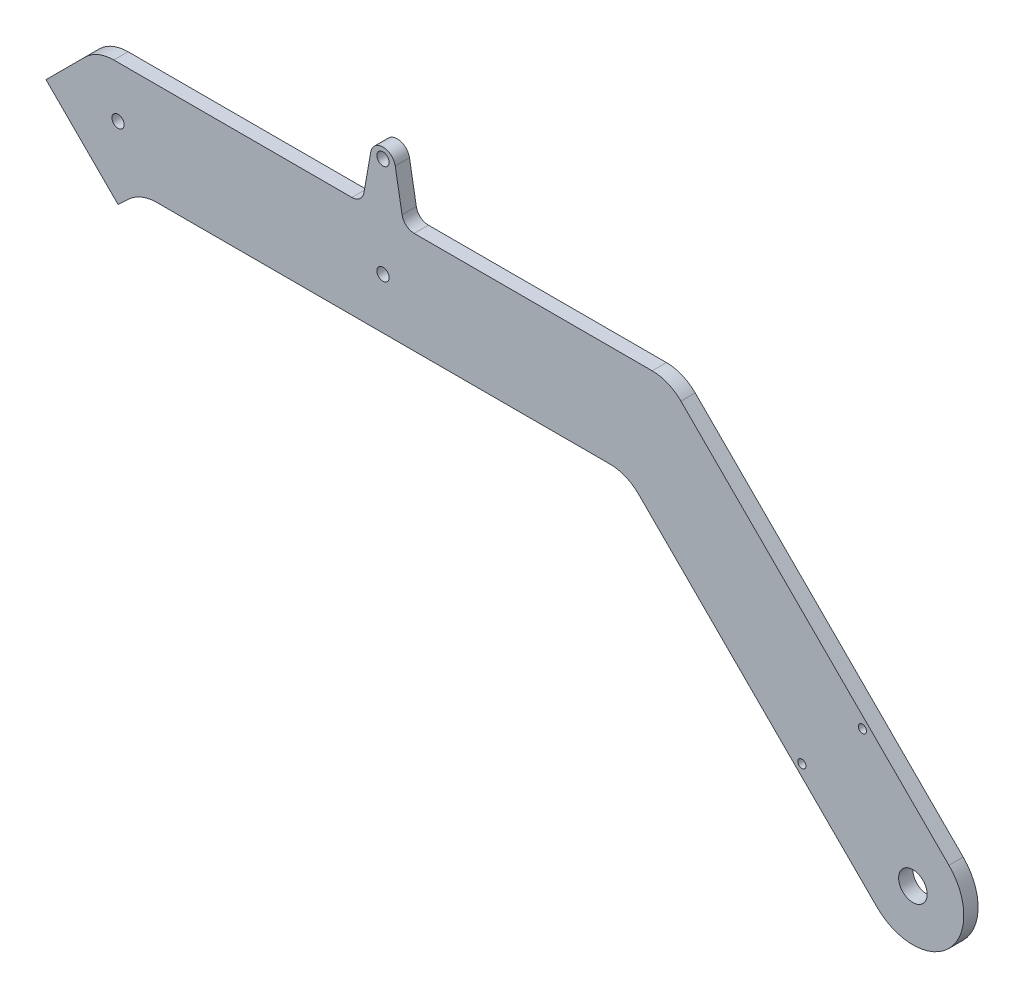
ISO-10303-21;
HEADER;
FILE_DESCRIPTION(('STEP AP214'),'2;1');
FILE_NAME('part.step','',(''),(''),'','','');
FILE_SCHEMA(('AUTOMOTIVE_DESIGN { 1 0 10303 214 1 1 1 1 }'));
ENDSEC;
DATA;
#1=APPLICATION_CONTEXT('core data for automotive mechanical design processes');
#2=APPLICATION_PROTOCOL_DEFINITION('international standard','automotive_design',2000,#1);
#3=PRODUCT_CONTEXT('',#1,'mechanical');
#4=PRODUCT('Part','Part','',(#3));
#5=PRODUCT_RELATED_PRODUCT_CATEGORY('part','',(#4));
#6=PRODUCT_DEFINITION_FORMATION('','',#4);
#7=PRODUCT_DEFINITION_CONTEXT('part definition',#1,'design');
#8=PRODUCT_DEFINITION('design','',#6,#7);
#9=PRODUCT_DEFINITION_SHAPE('','',#8);
#10=(LENGTH_UNIT() NAMED_UNIT(*) SI_UNIT(.MILLI.,.METRE.));
#11=(NAMED_UNIT(*) PLANE_ANGLE_UNIT() SI_UNIT($,.RADIAN.));
#12=(NAMED_UNIT(*) SI_UNIT($,.STERADIAN.) SOLID_ANGLE_UNIT());
#13=UNCERTAINTY_MEASURE_WITH_UNIT(LENGTH_MEASURE(1.E-05),#10,'distance_accuracy_value','');
#14=(GEOMETRIC_REPRESENTATION_CONTEXT(3) GLOBAL_UNCERTAINTY_ASSIGNED_CONTEXT((#13)) GLOBAL_UNIT_ASSIGNED_CONTEXT((#10,
#11,#12)) REPRESENTATION_CONTEXT('',''));
#15=CARTESIAN_POINT('',(0.,0.,0.));
#16=DIRECTION('',(0.,0.,1.));
#17=DIRECTION('',(1.,0.,0.));
#18=AXIS2_PLACEMENT_3D('',#15,#16,#17);
#19=CARTESIAN_POINT('',(195.,1.22188156226242E-13,3.5));
#20=DIRECTION('',(0.,0.,-1.));
#21=DIRECTION('',(-1.,0.,0.));
#22=AXIS2_PLACEMENT_3D('',#19,#20,#21);
#23=PLANE('',#22);
#24=CARTESIAN_POINT('',(167.776388924318,12.3743686707647,3.5));
#25=DIRECTION('',(0.,0.,-1.));
#26=DIRECTION('',(-1.,0.,0.));
#27=AXIS2_PLACEMENT_3D('',#24,#25,#26);
#28=CIRCLE('',#27,0.999999999999998);
#29=CARTESIAN_POINT('',(166.776388924318,12.3743686707647,3.5));
#30=VERTEX_POINT('',#29);
#31=EDGE_CURVE('E605',#30,#30,#28,.T.);
#32=ORIENTED_EDGE('',*,*,#31,.T.);
#33=EDGE_LOOP('',(#32));
#34=FACE_BOUND('',#33,.T.);
#35=CARTESIAN_POINT('',(182.625631329236,27.2236110756822,3.5));
#36=DIRECTION('',(0.,0.,-1.));
#37=DIRECTION('',(-1.,0.,0.));
#38=AXIS2_PLACEMENT_3D('',#35,#36,#37);
#39=CIRCLE('',#38,1.00000000000003);
#40=CARTESIAN_POINT('',(181.625631329236,27.2236110756822,3.5));
#41=VERTEX_POINT('',#40);
#42=EDGE_CURVE('E609',#41,#41,#39,.T.);
#43=ORIENTED_EDGE('',*,*,#42,.T.);
#44=EDGE_LOOP('',(#43));
#45=FACE_BOUND('',#44,.T.);
#46=DIRECTION('',(-0.707106781186548,0.707106781186547,0.));
#47=VECTOR('',#46,1.);
#48=CARTESIAN_POINT('',(135.177669529664,77.5000000000002,3.5));
#49=LINE('',#48,#47);
#50=CARTESIAN_POINT('',(203.838834764832,8.83883476483199,3.5));
#51=VERTEX_POINT('',#50);
#52=CARTESIAN_POINT('',(138.106601717798,74.5710678118657,3.5));
#53=VERTEX_POINT('',#52);
#54=EDGE_CURVE('E188',#51,#53,#49,.T.);
#55=ORIENTED_EDGE('',*,*,#54,.T.);
#56=CARTESIAN_POINT('',(131.035533905933,67.5000000000002,3.5));
#57=DIRECTION('',(0.,0.,-1.));
#58=DIRECTION('',(-1.,0.,0.));
#59=AXIS2_PLACEMENT_3D('',#56,#57,#58);
#60=CIRCLE('',#59,10.);
#61=CARTESIAN_POINT('',(131.035533905933,77.5000000000002,3.5));
#62=VERTEX_POINT('',#61);
#63=EDGE_CURVE('E263',#53,#62,#60,.F.);
#64=ORIENTED_EDGE('',*,*,#63,.T.);
#65=DIRECTION('',(-1.,0.,0.));
#66=VECTOR('',#65,1.);
#67=CARTESIAN_POINT('',(70.1159237685017,77.5000000000003,3.5));
#68=LINE('',#67,#66);
#69=CARTESIAN_POINT('',(72.6332226620335,77.5000000000003,3.5));
#70=VERTEX_POINT('',#69);
#71=EDGE_CURVE('E190',#62,#70,#68,.T.);
#72=ORIENTED_EDGE('',*,*,#71,.T.);
#73=CARTESIAN_POINT('',(72.6332226620335,80.5000000000003,3.5));
#74=DIRECTION('',(0.,0.,-1.));
#75=DIRECTION('',(-1.,0.,0.));
#76=AXIS2_PLACEMENT_3D('',#73,#74,#75);
#77=CIRCLE('',#76,3.);
#78=CARTESIAN_POINT('',(69.6787994029969,79.9790554669995,3.5));
#79=VERTEX_POINT('',#78);
#80=EDGE_CURVE('E11',#70,#79,#77,.T.);
#81=ORIENTED_EDGE('',*,*,#80,.T.);
#82=DIRECTION('',(-0.173648177666929,0.984807753012208,0.));
#83=VECTOR('',#82,1.);
#84=CARTESIAN_POINT('',(70.1159237685017,77.5000000000003,3.5));
#85=LINE('',#84,#83);
#86=CARTESIAN_POINT('',(68.0000000000001,89.5000000000003,3.5));
#87=VERTEX_POINT('',#86);
#88=EDGE_CURVE('E195',#79,#87,#85,.T.);
#89=ORIENTED_EDGE('',*,*,#88,.T.);
#90=CARTESIAN_POINT('',(65.0000000000001,88.9710190578749,3.5));
#91=DIRECTION('',(0.,0.,1.));
#92=DIRECTION('',(1.,0.,0.));
#93=AXIS2_PLACEMENT_3D('',#90,#91,#92);
#94=CIRCLE('',#93,3.04627983565722);
#95=CARTESIAN_POINT('',(62.0000000000001,89.5000000000003,3.5));
#96=VERTEX_POINT('',#95);
#97=EDGE_CURVE('E197',#87,#96,#94,.T.);
#98=ORIENTED_EDGE('',*,*,#97,.T.);
#99=DIRECTION('',(-0.173648177666927,-0.984807753012209,0.));
#100=VECTOR('',#99,1.);
#101=CARTESIAN_POINT('',(59.8840762314986,77.5000000000003,3.5));
#102=LINE('',#101,#100);
#103=CARTESIAN_POINT('',(60.3212005970034,79.9790554669995,3.5));
#104=VERTEX_POINT('',#103);
#105=EDGE_CURVE('E199',#96,#104,#102,.T.);
#106=ORIENTED_EDGE('',*,*,#105,.T.);
#107=CARTESIAN_POINT('',(57.3667773379668,80.5000000000003,3.5));
#108=DIRECTION('',(0.,0.,-1.));
#109=DIRECTION('',(-1.,0.,0.));
#110=AXIS2_PLACEMENT_3D('',#107,#108,#109);
#111=CIRCLE('',#110,3.);
#112=CARTESIAN_POINT('',(57.3667773379668,77.5000000000003,3.5));
#113=VERTEX_POINT('',#112);
#114=EDGE_CURVE('E298',#104,#113,#111,.T.);
#115=ORIENTED_EDGE('',*,*,#114,.T.);
#116=DIRECTION('',(-1.,0.,0.));
#117=VECTOR('',#116,1.);
#118=CARTESIAN_POINT('',(-5.17766952966342,77.5000000000003,3.5));
#119=LINE('',#118,#117);
#120=CARTESIAN_POINT('',(-1.03553390593246,77.5000000000003,3.5));
#121=VERTEX_POINT('',#120);
#122=EDGE_CURVE('E202',#113,#121,#119,.T.);
#123=ORIENTED_EDGE('',*,*,#122,.T.);
#124=CARTESIAN_POINT('',(-1.03553390593246,67.5000000000003,3.5));
#125=DIRECTION('',(0.,0.,-1.));
#126=DIRECTION('',(-1.,0.,0.));
#127=AXIS2_PLACEMENT_3D('',#124,#125,#126);
#128=CIRCLE('',#127,10.);
#129=CARTESIAN_POINT('',(-8.10660171779794,74.5710678118657,3.5));
#130=VERTEX_POINT('',#129);
#131=EDGE_CURVE('E261',#121,#130,#128,.F.);
#132=ORIENTED_EDGE('',*,*,#131,.T.);
#133=DIRECTION('',(-0.707106781186547,-0.707106781186548,0.));
#134=VECTOR('',#133,1.);
#135=CARTESIAN_POINT('',(-17.6776695296635,65.0000000000002,3.5));
#136=LINE('',#135,#134);
#137=CARTESIAN_POINT('',(-17.6776695296635,65.0000000000002,3.5));
#138=VERTEX_POINT('',#137);
#139=EDGE_CURVE('E204',#130,#138,#136,.T.);
#140=ORIENTED_EDGE('',*,*,#139,.T.);
#141=DIRECTION('',(0.707106781186548,-0.707106781186547,0.));
#142=VECTOR('',#141,1.);
#143=CARTESIAN_POINT('',(2.22044604925031E-13,47.3223304703365,3.5));
#144=LINE('',#143,#142);
#145=CARTESIAN_POINT('',(2.22044604925031E-13,47.3223304703365,3.5));
#146=VERTEX_POINT('',#145);
#147=EDGE_CURVE('E206',#138,#146,#144,.T.);
#148=ORIENTED_EDGE('',*,*,#147,.T.);
#149=DIRECTION('',(0.731786327517775,0.68153413036916,0.));
#150=VECTOR('',#149,1.);
#151=CARTESIAN_POINT('',(5.55943950768995,52.5000000000002,3.5));
#152=LINE('',#151,#150);
#153=CARTESIAN_POINT('',(2.67953827267025,49.817863275178,3.5));
#154=VERTEX_POINT('',#153);
#155=EDGE_CURVE('E208',#146,#154,#152,.T.);
#156=ORIENTED_EDGE('',*,*,#155,.T.);
#157=CARTESIAN_POINT('',(9.49487957636184,42.5000000000002,3.5));
#158=DIRECTION('',(0.,0.,-1.));
#159=DIRECTION('',(-1.,0.,0.));
#160=AXIS2_PLACEMENT_3D('',#157,#158,#159);
#161=CIRCLE('',#160,10.);
#162=CARTESIAN_POINT('',(9.49487957636184,52.5000000000002,3.5));
#163=VERTEX_POINT('',#162);
#164=EDGE_CURVE('E285',#154,#163,#161,.T.);
#165=ORIENTED_EDGE('',*,*,#164,.T.);
#166=DIRECTION('',(1.,0.,0.));
#167=VECTOR('',#166,1.);
#168=CARTESIAN_POINT('',(5.55943950768995,52.5000000000002,3.5));
#169=LINE('',#168,#167);
#170=CARTESIAN_POINT('',(120.680194846605,52.5000000000002,3.5));
#171=VERTEX_POINT('',#170);
#172=EDGE_CURVE('E173',#163,#171,#169,.T.);
#173=ORIENTED_EDGE('',*,*,#172,.T.);
#174=CARTESIAN_POINT('',(120.680194846605,42.5000000000002,3.5));
#175=DIRECTION('',(0.,0.,-1.));
#176=DIRECTION('',(-1.,0.,0.));
#177=AXIS2_PLACEMENT_3D('',#174,#175,#176);
#178=CIRCLE('',#177,10.);
#179=CARTESIAN_POINT('',(127.751262658471,49.5710678118657,3.5));
#180=VERTEX_POINT('',#179);
#181=EDGE_CURVE('E169',#171,#180,#178,.T.);
#182=ORIENTED_EDGE('',*,*,#181,.T.);
#183=DIRECTION('',(0.707106781186548,-0.707106781186547,0.));
#184=VECTOR('',#183,1.);
#185=CARTESIAN_POINT('',(124.822330470336,52.5000000000002,3.5));
#186=LINE('',#185,#184);
#187=CARTESIAN_POINT('',(186.161165235168,-8.83883476483178,3.5));
#188=VERTEX_POINT('',#187);
#189=EDGE_CURVE('E160',#180,#188,#186,.T.);
#190=ORIENTED_EDGE('',*,*,#189,.T.);
#191=CARTESIAN_POINT('',(195.,1.22188156226242E-13,3.5));
#192=DIRECTION('',(0.,0.,1.));
#193=DIRECTION('',(-1.,0.,0.));
#194=AXIS2_PLACEMENT_3D('',#191,#192,#193);
#195=CIRCLE('',#194,12.5);
#196=EDGE_CURVE('E165',#188,#51,#195,.T.);
#197=ORIENTED_EDGE('',*,*,#196,.T.);
#198=EDGE_LOOP('',(#55,#64,#72,#81,#89,#98,#106,#115,#123,#132,#140,#148,#156,#165,#173,#182,
#190,#197));
#199=FACE_BOUND('',#198,.T.);
#200=CARTESIAN_POINT('',(195.,1.22188156226242E-13,3.5));
#201=DIRECTION('',(0.,0.,1.));
#202=DIRECTION('',(1.,0.,0.));
#203=AXIS2_PLACEMENT_3D('',#200,#201,#202);
#204=CIRCLE('',#203,3.49999999999999);
#205=CARTESIAN_POINT('',(198.5,1.22188156226242E-13,3.5));
#206=VERTEX_POINT('',#205);
#207=EDGE_CURVE('E215',#206,#206,#204,.T.);
#208=ORIENTED_EDGE('',*,*,#207,.F.);
#209=EDGE_LOOP('',(#208));
#210=FACE_BOUND('',#209,.T.);
#211=CARTESIAN_POINT('',(65.0000000000001,65.0000000000003,3.5));
#212=DIRECTION('',(0.,0.,1.));
#213=DIRECTION('',(1.,0.,0.));
#214=AXIS2_PLACEMENT_3D('',#211,#212,#213);
#215=CIRCLE('',#214,1.5);
#216=CARTESIAN_POINT('',(66.5000000000001,65.0000000000003,3.5));
#217=VERTEX_POINT('',#216);
#218=EDGE_CURVE('E587',#217,#217,#215,.T.);
#219=ORIENTED_EDGE('',*,*,#218,.F.);
#220=EDGE_LOOP('',(#219));
#221=FACE_BOUND('',#220,.T.);
#222=CARTESIAN_POINT('',(2.51969836731242E-13,65.0000000000002,3.5));
#223=DIRECTION('',(0.,0.,1.));
#224=DIRECTION('',(1.,0.,0.));
#225=AXIS2_PLACEMENT_3D('',#222,#223,#224);
#226=CIRCLE('',#225,1.5);
#227=CARTESIAN_POINT('',(1.50000000000025,65.0000000000002,3.5));
#228=VERTEX_POINT('',#227);
#229=EDGE_CURVE('E593',#228,#228,#226,.T.);
#230=ORIENTED_EDGE('',*,*,#229,.F.);
#231=EDGE_LOOP('',(#230));
#232=FACE_BOUND('',#231,.T.);
#233=CARTESIAN_POINT('',(65.0000000000001,89.5000000000003,3.5));
#234=DIRECTION('',(0.,0.,1.));
#235=DIRECTION('',(1.,0.,0.));
#236=AXIS2_PLACEMENT_3D('',#233,#234,#235);
#237=CIRCLE('',#236,1.5);
#238=CARTESIAN_POINT('',(66.5000000000001,89.5000000000003,3.5));
#239=VERTEX_POINT('',#238);
#240=EDGE_CURVE('E599',#239,#239,#237,.T.);
#241=ORIENTED_EDGE('',*,*,#240,.F.);
#242=EDGE_LOOP('',(#241));
#243=FACE_BOUND('',#242,.T.);
#244=ADVANCED_FACE('F36',(#34,#45,#199,#210,#221,#232,#243),#23,.F.);
#245=CARTESIAN_POINT('',(195.,1.22188156226242E-13,0.));
#246=DIRECTION('',(0.,0.,-1.));
#247=DIRECTION('',(-1.,0.,0.));
#248=AXIS2_PLACEMENT_3D('',#245,#246,#247);
#249=PLANE('',#248);
#250=CARTESIAN_POINT('',(167.776388924318,12.3743686707647,0.));
#251=DIRECTION('',(0.,0.,-1.));
#252=DIRECTION('',(-1.,0.,0.));
#253=AXIS2_PLACEMENT_3D('',#250,#251,#252);
#254=CIRCLE('',#253,0.999999999999998);
#255=CARTESIAN_POINT('',(166.776388924318,12.3743686707647,0.));
#256=VERTEX_POINT('',#255);
#257=EDGE_CURVE('E612',#256,#256,#254,.T.);
#258=ORIENTED_EDGE('',*,*,#257,.F.);
#259=EDGE_LOOP('',(#258));
#260=FACE_BOUND('',#259,.T.);
#261=CARTESIAN_POINT('',(182.625631329236,27.2236110756822,0.));
#262=DIRECTION('',(0.,0.,-1.));
#263=DIRECTION('',(1.,0.,0.));
#264=AXIS2_PLACEMENT_3D('',#261,#262,#263);
#265=CIRCLE('',#264,1.00000000000003);
#266=CARTESIAN_POINT('',(183.625631329236,27.2236110756822,0.));
#267=VERTEX_POINT('',#266);
#268=EDGE_CURVE('E613',#267,#267,#265,.T.);
#269=ORIENTED_EDGE('',*,*,#268,.F.);
#270=EDGE_LOOP('',(#269));
#271=FACE_BOUND('',#270,.T.);
#272=CARTESIAN_POINT('',(2.51969836731242E-13,65.0000000000002,0.));
#273=DIRECTION('',(0.,0.,1.));
#274=DIRECTION('',(1.,0.,0.));
#275=AXIS2_PLACEMENT_3D('',#272,#273,#274);
#276=CIRCLE('',#275,1.5);
#277=CARTESIAN_POINT('',(1.50000000000025,65.0000000000002,0.));
#278=VERTEX_POINT('',#277);
#279=EDGE_CURVE('E596',#278,#278,#276,.T.);
#280=ORIENTED_EDGE('',*,*,#279,.T.);
#281=EDGE_LOOP('',(#280));
#282=FACE_BOUND('',#281,.T.);
#283=CARTESIAN_POINT('',(195.,1.22188156226242E-13,0.));
#284=DIRECTION('',(0.,0.,1.));
#285=DIRECTION('',(1.,0.,0.));
#286=AXIS2_PLACEMENT_3D('',#283,#284,#285);
#287=CIRCLE('',#286,3.49999999999999);
#288=CARTESIAN_POINT('',(198.5,1.22188156226242E-13,0.));
#289=VERTEX_POINT('',#288);
#290=EDGE_CURVE('E584',#289,#289,#287,.T.);
#291=ORIENTED_EDGE('',*,*,#290,.T.);
#292=EDGE_LOOP('',(#291));
#293=FACE_BOUND('',#292,.T.);
#294=DIRECTION('',(-1.,0.,0.));
#295=VECTOR('',#294,1.);
#296=CARTESIAN_POINT('',(70.1159237685017,77.5000000000003,0.));
#297=LINE('',#296,#295);
#298=CARTESIAN_POINT('',(131.035533905933,77.5000000000002,0.));
#299=VERTEX_POINT('',#298);
#300=CARTESIAN_POINT('',(72.6332226620335,77.5000000000003,0.));
#301=VERTEX_POINT('',#300);
#302=EDGE_CURVE('E222',#299,#301,#297,.T.);
#303=ORIENTED_EDGE('',*,*,#302,.F.);
#304=CARTESIAN_POINT('',(131.035533905933,67.5000000000002,0.));
#305=DIRECTION('',(0.,0.,-1.));
#306=DIRECTION('',(-1.,0.,0.));
#307=AXIS2_PLACEMENT_3D('',#304,#305,#306);
#308=CIRCLE('',#307,10.);
#309=CARTESIAN_POINT('',(138.106601717798,74.5710678118657,0.));
#310=VERTEX_POINT('',#309);
#311=EDGE_CURVE('E257',#299,#310,#308,.T.);
#312=ORIENTED_EDGE('',*,*,#311,.T.);
#313=DIRECTION('',(-0.707106781186548,0.707106781186547,0.));
#314=VECTOR('',#313,1.);
#315=CARTESIAN_POINT('',(135.177669529664,77.5000000000002,0.));
#316=LINE('',#315,#314);
#317=CARTESIAN_POINT('',(203.838834764832,8.83883476483199,0.));
#318=VERTEX_POINT('',#317);
#319=EDGE_CURVE('E219',#318,#310,#316,.T.);
#320=ORIENTED_EDGE('',*,*,#319,.F.);
#321=CARTESIAN_POINT('',(195.,1.22188156226242E-13,0.));
#322=DIRECTION('',(0.,0.,1.));
#323=DIRECTION('',(-1.,0.,0.));
#324=AXIS2_PLACEMENT_3D('',#321,#322,#323);
#325=CIRCLE('',#324,12.5);
#326=CARTESIAN_POINT('',(186.161165235168,-8.83883476483178,0.));
#327=VERTEX_POINT('',#326);
#328=EDGE_CURVE('E217',#327,#318,#325,.T.);
#329=ORIENTED_EDGE('',*,*,#328,.F.);
#330=DIRECTION('',(0.707106781186548,-0.707106781186547,0.));
#331=VECTOR('',#330,1.);
#332=CARTESIAN_POINT('',(124.822330470336,52.5000000000002,0.));
#333=LINE('',#332,#331);
#334=CARTESIAN_POINT('',(127.751262658471,49.5710678118657,0.));
#335=VERTEX_POINT('',#334);
#336=EDGE_CURVE('E179',#335,#327,#333,.T.);
#337=ORIENTED_EDGE('',*,*,#336,.F.);
#338=CARTESIAN_POINT('',(120.680194846605,42.5000000000002,0.));
#339=DIRECTION('',(0.,0.,-1.));
#340=DIRECTION('',(-1.,0.,0.));
#341=AXIS2_PLACEMENT_3D('',#338,#339,#340);
#342=CIRCLE('',#341,10.);
#343=CARTESIAN_POINT('',(120.680194846605,52.5000000000002,0.));
#344=VERTEX_POINT('',#343);
#345=EDGE_CURVE('E280',#335,#344,#342,.F.);
#346=ORIENTED_EDGE('',*,*,#345,.T.);
#347=DIRECTION('',(1.,0.,0.));
#348=VECTOR('',#347,1.);
#349=CARTESIAN_POINT('',(5.55943950768995,52.5000000000002,0.));
#350=LINE('',#349,#348);
#351=CARTESIAN_POINT('',(9.49487957636184,52.5000000000002,0.));
#352=VERTEX_POINT('',#351);
#353=EDGE_CURVE('E212',#352,#344,#350,.T.);
#354=ORIENTED_EDGE('',*,*,#353,.F.);
#355=CARTESIAN_POINT('',(9.49487957636184,42.5000000000002,0.));
#356=DIRECTION('',(0.,0.,-1.));
#357=DIRECTION('',(-1.,0.,0.));
#358=AXIS2_PLACEMENT_3D('',#355,#356,#357);
#359=CIRCLE('',#358,10.);
#360=CARTESIAN_POINT('',(2.67953827267025,49.817863275178,0.));
#361=VERTEX_POINT('',#360);
#362=EDGE_CURVE('E283',#352,#361,#359,.F.);
#363=ORIENTED_EDGE('',*,*,#362,.T.);
#364=DIRECTION('',(0.731786327517775,0.68153413036916,0.));
#365=VECTOR('',#364,1.);
#366=CARTESIAN_POINT('',(5.55943950768995,52.5000000000002,0.));
#367=LINE('',#366,#365);
#368=CARTESIAN_POINT('',(2.22044604925031E-13,47.3223304703365,0.));
#369=VERTEX_POINT('',#368);
#370=EDGE_CURVE('E237',#369,#361,#367,.T.);
#371=ORIENTED_EDGE('',*,*,#370,.F.);
#372=DIRECTION('',(0.707106781186548,-0.707106781186547,0.));
#373=VECTOR('',#372,1.);
#374=CARTESIAN_POINT('',(2.22044604925031E-13,47.3223304703365,0.));
#375=LINE('',#374,#373);
#376=CARTESIAN_POINT('',(-17.6776695296635,65.0000000000002,0.));
#377=VERTEX_POINT('',#376);
#378=EDGE_CURVE('E235',#377,#369,#375,.T.);
#379=ORIENTED_EDGE('',*,*,#378,.F.);
#380=DIRECTION('',(-0.707106781186547,-0.707106781186548,0.));
#381=VECTOR('',#380,1.);
#382=CARTESIAN_POINT('',(-17.6776695296635,65.0000000000002,0.));
#383=LINE('',#382,#381);
#384=CARTESIAN_POINT('',(-8.10660171779794,74.5710678118657,0.));
#385=VERTEX_POINT('',#384);
#386=EDGE_CURVE('E233',#385,#377,#383,.T.);
#387=ORIENTED_EDGE('',*,*,#386,.F.);
#388=CARTESIAN_POINT('',(-1.03553390593246,67.5000000000003,0.));
#389=DIRECTION('',(0.,0.,-1.));
#390=DIRECTION('',(-1.,0.,0.));
#391=AXIS2_PLACEMENT_3D('',#388,#389,#390);
#392=CIRCLE('',#391,10.);
#393=CARTESIAN_POINT('',(-1.03553390593246,77.5000000000003,0.));
#394=VERTEX_POINT('',#393);
#395=EDGE_CURVE('E254',#385,#394,#392,.T.);
#396=ORIENTED_EDGE('',*,*,#395,.T.);
#397=DIRECTION('',(-1.,0.,0.));
#398=VECTOR('',#397,1.);
#399=CARTESIAN_POINT('',(-5.17766952966342,77.5000000000003,0.));
#400=LINE('',#399,#398);
#401=CARTESIAN_POINT('',(57.3667773379668,77.5000000000003,0.));
#402=VERTEX_POINT('',#401);
#403=EDGE_CURVE('E231',#402,#394,#400,.T.);
#404=ORIENTED_EDGE('',*,*,#403,.F.);
#405=CARTESIAN_POINT('',(57.3667773379668,80.5000000000003,0.));
#406=DIRECTION('',(0.,0.,-1.));
#407=DIRECTION('',(-1.,0.,0.));
#408=AXIS2_PLACEMENT_3D('',#405,#406,#407);
#409=CIRCLE('',#408,3.);
#410=CARTESIAN_POINT('',(60.3212005970034,79.9790554669995,0.));
#411=VERTEX_POINT('',#410);
#412=EDGE_CURVE('E296',#402,#411,#409,.F.);
#413=ORIENTED_EDGE('',*,*,#412,.T.);
#414=DIRECTION('',(-0.173648177666927,-0.984807753012209,0.));
#415=VECTOR('',#414,1.);
#416=CARTESIAN_POINT('',(59.8840762314986,77.5000000000003,0.));
#417=LINE('',#416,#415);
#418=CARTESIAN_POINT('',(62.0000000000001,89.5000000000003,0.));
#419=VERTEX_POINT('',#418);
#420=EDGE_CURVE('E228',#419,#411,#417,.T.);
#421=ORIENTED_EDGE('',*,*,#420,.F.);
#422=CARTESIAN_POINT('',(65.0000000000001,88.9710190578749,0.));
#423=DIRECTION('',(0.,0.,1.));
#424=DIRECTION('',(1.,0.,0.));
#425=AXIS2_PLACEMENT_3D('',#422,#423,#424);
#426=CIRCLE('',#425,3.04627983565722);
#427=CARTESIAN_POINT('',(68.0000000000001,89.5000000000003,0.));
#428=VERTEX_POINT('',#427);
#429=EDGE_CURVE('E226',#428,#419,#426,.T.);
#430=ORIENTED_EDGE('',*,*,#429,.F.);
#431=DIRECTION('',(-0.173648177666929,0.984807753012208,0.));
#432=VECTOR('',#431,1.);
#433=CARTESIAN_POINT('',(70.1159237685017,77.5000000000003,0.));
#434=LINE('',#433,#432);
#435=CARTESIAN_POINT('',(69.6787994029969,79.9790554669995,0.));
#436=VERTEX_POINT('',#435);
#437=EDGE_CURVE('E224',#436,#428,#434,.T.);
#438=ORIENTED_EDGE('',*,*,#437,.F.);
#439=CARTESIAN_POINT('',(72.6332226620335,80.5000000000003,0.));
#440=DIRECTION('',(0.,0.,-1.));
#441=DIRECTION('',(-1.,0.,0.));
#442=AXIS2_PLACEMENT_3D('',#439,#440,#441);
#443=CIRCLE('',#442,3.);
#444=EDGE_CURVE('E44',#436,#301,#443,.F.);
#445=ORIENTED_EDGE('',*,*,#444,.T.);
#446=EDGE_LOOP('',(#303,#312,#320,#329,#337,#346,#354,#363,#371,#379,#387,#396,#404,#413,#421,
#430,#438,#445));
#447=FACE_BOUND('',#446,.T.);
#448=CARTESIAN_POINT('',(65.0000000000001,65.0000000000003,0.));
#449=DIRECTION('',(0.,0.,1.));
#450=DIRECTION('',(1.,0.,0.));
#451=AXIS2_PLACEMENT_3D('',#448,#449,#450);
#452=CIRCLE('',#451,1.5);
#453=CARTESIAN_POINT('',(66.5000000000001,65.0000000000003,0.));
#454=VERTEX_POINT('',#453);
#455=EDGE_CURVE('E590',#454,#454,#452,.T.);
#456=ORIENTED_EDGE('',*,*,#455,.T.);
#457=EDGE_LOOP('',(#456));
#458=FACE_BOUND('',#457,.T.);
#459=CARTESIAN_POINT('',(65.0000000000001,89.5000000000003,0.));
#460=DIRECTION('',(0.,0.,1.));
#461=DIRECTION('',(1.,0.,0.));
#462=AXIS2_PLACEMENT_3D('',#459,#460,#461);
#463=CIRCLE('',#462,1.5);
#464=CARTESIAN_POINT('',(66.5000000000001,89.5000000000003,0.));
#465=VERTEX_POINT('',#464);
#466=EDGE_CURVE('E602',#465,#465,#463,.T.);
#467=ORIENTED_EDGE('',*,*,#466,.T.);
#468=EDGE_LOOP('',(#467));
#469=FACE_BOUND('',#468,.T.);
#470=ADVANCED_FACE('F312',(#260,#271,#282,#293,#447,#458,#469),#249,.T.);
#471=CARTESIAN_POINT('',(5.55943950768995,52.5000000000002,3.5));
#472=DIRECTION('',(0.,1.,0.));
#473=DIRECTION('',(0.,0.,1.));
#474=AXIS2_PLACEMENT_3D('',#471,#472,#473);
#475=PLANE('',#474);
#476=ORIENTED_EDGE('',*,*,#353,.T.);
#477=DIRECTION('',(0.,0.,-1.));
#478=VECTOR('',#477,1.);
#479=CARTESIAN_POINT('',(120.680194846605,52.5000000000002,3.5));
#480=LINE('',#479,#478);
#481=EDGE_CURVE('E270',#344,#171,#480,.F.);
#482=ORIENTED_EDGE('',*,*,#481,.T.);
#483=ORIENTED_EDGE('',*,*,#172,.F.);
#484=DIRECTION('',(0.,0.,-1.));
#485=VECTOR('',#484,1.);
#486=CARTESIAN_POINT('',(9.49487957636184,52.5000000000002,0.));
#487=LINE('',#486,#485);
#488=EDGE_CURVE('E267',#163,#352,#487,.T.);
#489=ORIENTED_EDGE('',*,*,#488,.T.);
#490=EDGE_LOOP('',(#476,#482,#483,#489));
#491=FACE_BOUND('',#490,.T.);
#492=ADVANCED_FACE('F351',(#491),#475,.F.);
#493=CARTESIAN_POINT('',(124.822330470336,52.5000000000002,3.5));
#494=DIRECTION('',(0.707106781186547,0.707106781186548,0.));
#495=DIRECTION('',(-0.707106781186548,0.707106781186547,0.));
#496=AXIS2_PLACEMENT_3D('',#493,#494,#495);
#497=PLANE('',#496);
#498=ORIENTED_EDGE('',*,*,#189,.F.);
#499=DIRECTION('',(0.,0.,-1.));
#500=VECTOR('',#499,1.);
#501=CARTESIAN_POINT('',(127.751262658471,49.5710678118657,0.));
#502=LINE('',#501,#500);
#503=EDGE_CURVE('E265',#180,#335,#502,.T.);
#504=ORIENTED_EDGE('',*,*,#503,.T.);
#505=ORIENTED_EDGE('',*,*,#336,.T.);
#506=DIRECTION('',(0.,0.,-1.));
#507=VECTOR('',#506,1.);
#508=CARTESIAN_POINT('',(186.161165235168,-8.83883476483178,3.5));
#509=LINE('',#508,#507);
#510=EDGE_CURVE('E176',#188,#327,#509,.T.);
#511=ORIENTED_EDGE('',*,*,#510,.F.);
#512=EDGE_LOOP('',(#498,#504,#505,#511));
#513=FACE_BOUND('',#512,.T.);
#514=ADVANCED_FACE('F177',(#513),#497,.F.);
#515=CARTESIAN_POINT('',(195.,1.22188156226242E-13,3.5));
#516=DIRECTION('',(0.,0.,-1.));
#517=DIRECTION('',(-1.,0.,0.));
#518=AXIS2_PLACEMENT_3D('',#515,#516,#517);
#519=CYLINDRICAL_SURFACE('',#518,12.5);
#520=ORIENTED_EDGE('',*,*,#328,.T.);
#521=DIRECTION('',(0.,0.,-1.));
#522=VECTOR('',#521,1.);
#523=CARTESIAN_POINT('',(203.838834764832,8.83883476483199,3.5));
#524=LINE('',#523,#522);
#525=EDGE_CURVE('E183',#51,#318,#524,.T.);
#526=ORIENTED_EDGE('',*,*,#525,.F.);
#527=ORIENTED_EDGE('',*,*,#196,.F.);
#528=ORIENTED_EDGE('',*,*,#510,.T.);
#529=EDGE_LOOP('',(#520,#526,#527,#528));
#530=FACE_BOUND('',#529,.T.);
#531=ADVANCED_FACE('F185',(#530),#519,.T.);
#532=CARTESIAN_POINT('',(135.177669529664,77.5000000000002,3.5));
#533=DIRECTION('',(-0.707106781186547,-0.707106781186548,0.));
#534=DIRECTION('',(0.707106781186548,-0.707106781186547,0.));
#535=AXIS2_PLACEMENT_3D('',#532,#533,#534);
#536=PLANE('',#535);
#537=ORIENTED_EDGE('',*,*,#319,.T.);
#538=DIRECTION('',(0.,0.,-1.));
#539=VECTOR('',#538,1.);
#540=CARTESIAN_POINT('',(138.106601717798,74.5710678118657,3.5));
#541=LINE('',#540,#539);
#542=EDGE_CURVE('E259',#310,#53,#541,.F.);
#543=ORIENTED_EDGE('',*,*,#542,.T.);
#544=ORIENTED_EDGE('',*,*,#54,.F.);
#545=ORIENTED_EDGE('',*,*,#525,.T.);
#546=EDGE_LOOP('',(#537,#543,#544,#545));
#547=FACE_BOUND('',#546,.T.);
#548=ADVANCED_FACE('F336',(#547),#536,.F.);
#549=CARTESIAN_POINT('',(70.1159237685017,77.5000000000003,3.5));
#550=DIRECTION('',(0.,-1.,0.));
#551=DIRECTION('',(1.,0.,0.));
#552=AXIS2_PLACEMENT_3D('',#549,#550,#551);
#553=PLANE('',#552);
#554=ORIENTED_EDGE('',*,*,#302,.T.);
#555=DIRECTION('',(0.,0.,-1.));
#556=VECTOR('',#555,1.);
#557=CARTESIAN_POINT('',(72.6332226620335,77.5000000000003,3.5));
#558=LINE('',#557,#556);
#559=EDGE_CURVE('E57',#301,#70,#558,.F.);
#560=ORIENTED_EDGE('',*,*,#559,.T.);
#561=ORIENTED_EDGE('',*,*,#71,.F.);
#562=DIRECTION('',(0.,0.,-1.));
#563=VECTOR('',#562,1.);
#564=CARTESIAN_POINT('',(131.035533905933,77.5000000000002,3.5));
#565=LINE('',#564,#563);
#566=EDGE_CURVE('E182',#62,#299,#565,.T.);
#567=ORIENTED_EDGE('',*,*,#566,.T.);
#568=EDGE_LOOP('',(#554,#560,#561,#567));
#569=FACE_BOUND('',#568,.T.);
#570=ADVANCED_FACE('F330',(#569),#553,.F.);
#571=CARTESIAN_POINT('',(70.1159237685017,77.5000000000003,3.5));
#572=DIRECTION('',(-0.984807753012208,-0.173648177666929,0.));
#573=DIRECTION('',(0.173648177666929,-0.984807753012208,0.));
#574=AXIS2_PLACEMENT_3D('',#571,#572,#573);
#575=PLANE('',#574);
#576=ORIENTED_EDGE('',*,*,#88,.F.);
#577=DIRECTION('',(0.,0.,-1.));
#578=VECTOR('',#577,1.);
#579=CARTESIAN_POINT('',(69.6787994029969,79.9790554669995,0.));
#580=LINE('',#579,#578);
#581=EDGE_CURVE('E292',#79,#436,#580,.T.);
#582=ORIENTED_EDGE('',*,*,#581,.T.);
#583=ORIENTED_EDGE('',*,*,#437,.T.);
#584=DIRECTION('',(0.,0.,-1.));
#585=VECTOR('',#584,1.);
#586=CARTESIAN_POINT('',(68.0000000000001,89.5000000000003,3.5));
#587=LINE('',#586,#585);
#588=EDGE_CURVE('E248',#87,#428,#587,.T.);
#589=ORIENTED_EDGE('',*,*,#588,.F.);
#590=EDGE_LOOP('',(#576,#582,#583,#589));
#591=FACE_BOUND('',#590,.T.);
#592=ADVANCED_FACE('F324',(#591),#575,.F.);
#593=CARTESIAN_POINT('',(65.0000000000001,88.9710190578749,3.5));
#594=DIRECTION('',(0.,0.,-1.));
#595=DIRECTION('',(-1.,0.,0.));
#596=AXIS2_PLACEMENT_3D('',#593,#594,#595);
#597=CYLINDRICAL_SURFACE('',#596,3.04627983565722);
#598=ORIENTED_EDGE('',*,*,#429,.T.);
#599=DIRECTION('',(0.,0.,-1.));
#600=VECTOR('',#599,1.);
#601=CARTESIAN_POINT('',(62.0000000000001,89.5000000000003,3.5));
#602=LINE('',#601,#600);
#603=EDGE_CURVE('E245',#96,#419,#602,.T.);
#604=ORIENTED_EDGE('',*,*,#603,.F.);
#605=ORIENTED_EDGE('',*,*,#97,.F.);
#606=ORIENTED_EDGE('',*,*,#588,.T.);
#607=EDGE_LOOP('',(#598,#604,#605,#606));
#608=FACE_BOUND('',#607,.T.);
#609=ADVANCED_FACE('F320',(#608),#597,.T.);
#610=CARTESIAN_POINT('',(59.8840762314986,77.5000000000003,3.5));
#611=DIRECTION('',(0.984807753012209,-0.173648177666927,0.));
#612=DIRECTION('',(0.173648177666927,0.984807753012209,0.));
#613=AXIS2_PLACEMENT_3D('',#610,#611,#612);
#614=PLANE('',#613);
#615=ORIENTED_EDGE('',*,*,#420,.T.);
#616=DIRECTION('',(0.,0.,-1.));
#617=VECTOR('',#616,1.);
#618=CARTESIAN_POINT('',(60.3212005970034,79.9790554669995,3.5));
#619=LINE('',#618,#617);
#620=EDGE_CURVE('E290',#411,#104,#619,.F.);
#621=ORIENTED_EDGE('',*,*,#620,.T.);
#622=ORIENTED_EDGE('',*,*,#105,.F.);
#623=ORIENTED_EDGE('',*,*,#603,.T.);
#624=EDGE_LOOP('',(#615,#621,#622,#623));
#625=FACE_BOUND('',#624,.T.);
#626=ADVANCED_FACE('F316',(#625),#614,.F.);
#627=CARTESIAN_POINT('',(-5.17766952966342,77.5000000000003,3.5));
#628=DIRECTION('',(0.,-1.,0.));
#629=DIRECTION('',(0.,0.,-1.));
#630=AXIS2_PLACEMENT_3D('',#627,#628,#629);
#631=PLANE('',#630);
#632=ORIENTED_EDGE('',*,*,#122,.F.);
#633=DIRECTION('',(0.,0.,-1.));
#634=VECTOR('',#633,1.);
#635=CARTESIAN_POINT('',(57.3667773379668,77.5000000000003,0.));
#636=LINE('',#635,#634);
#637=EDGE_CURVE('E287',#113,#402,#636,.T.);
#638=ORIENTED_EDGE('',*,*,#637,.T.);
#639=ORIENTED_EDGE('',*,*,#403,.T.);
#640=DIRECTION('',(0.,0.,-1.));
#641=VECTOR('',#640,1.);
#642=CARTESIAN_POINT('',(-1.03553390593246,77.5000000000003,3.5));
#643=LINE('',#642,#641);
#644=EDGE_CURVE('E277',#394,#121,#643,.F.);
#645=ORIENTED_EDGE('',*,*,#644,.T.);
#646=EDGE_LOOP('',(#632,#638,#639,#645));
#647=FACE_BOUND('',#646,.T.);
#648=ADVANCED_FACE('F306',(#647),#631,.F.);
#649=CARTESIAN_POINT('',(-17.6776695296635,65.0000000000002,3.5));
#650=DIRECTION('',(0.707106781186548,-0.707106781186548,0.));
#651=DIRECTION('',(0.707106781186547,0.707106781186548,0.));
#652=AXIS2_PLACEMENT_3D('',#649,#650,#651);
#653=PLANE('',#652);
#654=ORIENTED_EDGE('',*,*,#139,.F.);
#655=DIRECTION('',(0.,0.,-1.));
#656=VECTOR('',#655,1.);
#657=CARTESIAN_POINT('',(-8.10660171779794,74.5710678118657,3.5));
#658=LINE('',#657,#656);
#659=EDGE_CURVE('E274',#130,#385,#658,.T.);
#660=ORIENTED_EDGE('',*,*,#659,.T.);
#661=ORIENTED_EDGE('',*,*,#386,.T.);
#662=DIRECTION('',(0.,0.,-1.));
#663=VECTOR('',#662,1.);
#664=CARTESIAN_POINT('',(-17.6776695296635,65.0000000000002,3.5));
#665=LINE('',#664,#663);
#666=EDGE_CURVE('E242',#138,#377,#665,.T.);
#667=ORIENTED_EDGE('',*,*,#666,.F.);
#668=EDGE_LOOP('',(#654,#660,#661,#667));
#669=FACE_BOUND('',#668,.T.);
#670=ADVANCED_FACE('F367',(#669),#653,.F.);
#671=CARTESIAN_POINT('',(2.22044604925031E-13,47.3223304703365,3.5));
#672=DIRECTION('',(0.707106781186547,0.707106781186548,0.));
#673=DIRECTION('',(-0.707106781186548,0.707106781186547,0.));
#674=AXIS2_PLACEMENT_3D('',#671,#672,#673);
#675=PLANE('',#674);
#676=ORIENTED_EDGE('',*,*,#378,.T.);
#677=DIRECTION('',(0.,0.,-1.));
#678=VECTOR('',#677,1.);
#679=CARTESIAN_POINT('',(2.22044604925031E-13,47.3223304703365,3.5));
#680=LINE('',#679,#678);
#681=EDGE_CURVE('E211',#146,#369,#680,.T.);
#682=ORIENTED_EDGE('',*,*,#681,.F.);
#683=ORIENTED_EDGE('',*,*,#147,.F.);
#684=ORIENTED_EDGE('',*,*,#666,.T.);
#685=EDGE_LOOP('',(#676,#682,#683,#684));
#686=FACE_BOUND('',#685,.T.);
#687=ADVANCED_FACE('F363',(#686),#675,.F.);
#688=CARTESIAN_POINT('',(5.55943950768995,52.5000000000002,3.5));
#689=DIRECTION('',(-0.68153413036916,0.731786327517776,0.));
#690=DIRECTION('',(-0.731786327517776,-0.68153413036916,0.));
#691=AXIS2_PLACEMENT_3D('',#688,#689,#690);
#692=PLANE('',#691);
#693=ORIENTED_EDGE('',*,*,#370,.T.);
#694=DIRECTION('',(0.,0.,-1.));
#695=VECTOR('',#694,1.);
#696=CARTESIAN_POINT('',(2.67953827267024,49.817863275178,3.5));
#697=LINE('',#696,#695);
#698=EDGE_CURVE('E272',#361,#154,#697,.F.);
#699=ORIENTED_EDGE('',*,*,#698,.T.);
#700=ORIENTED_EDGE('',*,*,#155,.F.);
#701=ORIENTED_EDGE('',*,*,#681,.T.);
#702=EDGE_LOOP('',(#693,#699,#700,#701));
#703=FACE_BOUND('',#702,.T.);
#704=ADVANCED_FACE('F360',(#703),#692,.F.);
#705=CARTESIAN_POINT('',(195.,1.22188156226242E-13,3.5));
#706=DIRECTION('',(0.,0.,-1.));
#707=DIRECTION('',(-1.,0.,0.));
#708=AXIS2_PLACEMENT_3D('',#705,#706,#707);
#709=CYLINDRICAL_SURFACE('',#708,3.49999999999999);
#710=ORIENTED_EDGE('',*,*,#207,.T.);
#711=EDGE_LOOP('',(#710));
#712=FACE_BOUND('',#711,.T.);
#713=ORIENTED_EDGE('',*,*,#290,.F.);
#714=EDGE_LOOP('',(#713));
#715=FACE_BOUND('',#714,.T.);
#716=ADVANCED_FACE('F357',(#712,#715),#709,.F.);
#717=CARTESIAN_POINT('',(65.0000000000001,65.0000000000003,3.5));
#718=DIRECTION('',(0.,0.,-1.));
#719=DIRECTION('',(-1.,0.,0.));
#720=AXIS2_PLACEMENT_3D('',#717,#718,#719);
#721=CYLINDRICAL_SURFACE('',#720,1.5);
#722=ORIENTED_EDGE('',*,*,#218,.T.);
#723=EDGE_LOOP('',(#722));
#724=FACE_BOUND('',#723,.T.);
#725=ORIENTED_EDGE('',*,*,#455,.F.);
#726=EDGE_LOOP('',(#725));
#727=FACE_BOUND('',#726,.T.);
#728=ADVANCED_FACE('F416',(#724,#727),#721,.F.);
#729=CARTESIAN_POINT('',(2.51969836731242E-13,65.0000000000002,3.5));
#730=DIRECTION('',(0.,0.,-1.));
#731=DIRECTION('',(-1.,0.,0.));
#732=AXIS2_PLACEMENT_3D('',#729,#730,#731);
#733=CYLINDRICAL_SURFACE('',#732,1.5);
#734=ORIENTED_EDGE('',*,*,#229,.T.);
#735=EDGE_LOOP('',(#734));
#736=FACE_BOUND('',#735,.T.);
#737=ORIENTED_EDGE('',*,*,#279,.F.);
#738=EDGE_LOOP('',(#737));
#739=FACE_BOUND('',#738,.T.);
#740=ADVANCED_FACE('F423',(#736,#739),#733,.F.);
#741=CARTESIAN_POINT('',(65.0000000000001,89.5000000000003,3.5));
#742=DIRECTION('',(0.,0.,-1.));
#743=DIRECTION('',(-1.,0.,0.));
#744=AXIS2_PLACEMENT_3D('',#741,#742,#743);
#745=CYLINDRICAL_SURFACE('',#744,1.5);
#746=ORIENTED_EDGE('',*,*,#240,.T.);
#747=EDGE_LOOP('',(#746));
#748=FACE_BOUND('',#747,.T.);
#749=ORIENTED_EDGE('',*,*,#466,.F.);
#750=EDGE_LOOP('',(#749));
#751=FACE_BOUND('',#750,.T.);
#752=ADVANCED_FACE('F430',(#748,#751),#745,.F.);
#753=CARTESIAN_POINT('',(131.035533905933,67.5000000000002,3.5));
#754=DIRECTION('',(0.,0.,-1.));
#755=DIRECTION('',(-1.,0.,0.));
#756=AXIS2_PLACEMENT_3D('',#753,#754,#755);
#757=CYLINDRICAL_SURFACE('',#756,10.);
#758=ORIENTED_EDGE('',*,*,#63,.F.);
#759=ORIENTED_EDGE('',*,*,#542,.F.);
#760=ORIENTED_EDGE('',*,*,#311,.F.);
#761=ORIENTED_EDGE('',*,*,#566,.F.);
#762=EDGE_LOOP('',(#758,#759,#760,#761));
#763=FACE_BOUND('',#762,.T.);
#764=ADVANCED_FACE('F332',(#763),#757,.T.);
#765=CARTESIAN_POINT('',(120.680194846605,42.5000000000002,3.5));
#766=DIRECTION('',(0.,0.,1.));
#767=DIRECTION('',(1.,0.,0.));
#768=AXIS2_PLACEMENT_3D('',#765,#766,#767);
#769=CYLINDRICAL_SURFACE('',#768,10.);
#770=ORIENTED_EDGE('',*,*,#181,.F.);
#771=ORIENTED_EDGE('',*,*,#481,.F.);
#772=ORIENTED_EDGE('',*,*,#345,.F.);
#773=ORIENTED_EDGE('',*,*,#503,.F.);
#774=EDGE_LOOP('',(#770,#771,#772,#773));
#775=FACE_BOUND('',#774,.T.);
#776=ADVANCED_FACE('F445',(#775),#769,.F.);
#777=CARTESIAN_POINT('',(9.49487957636184,42.5000000000002,3.5));
#778=DIRECTION('',(0.,0.,1.));
#779=DIRECTION('',(1.,0.,0.));
#780=AXIS2_PLACEMENT_3D('',#777,#778,#779);
#781=CYLINDRICAL_SURFACE('',#780,10.);
#782=ORIENTED_EDGE('',*,*,#164,.F.);
#783=ORIENTED_EDGE('',*,*,#698,.F.);
#784=ORIENTED_EDGE('',*,*,#362,.F.);
#785=ORIENTED_EDGE('',*,*,#488,.F.);
#786=EDGE_LOOP('',(#782,#783,#784,#785));
#787=FACE_BOUND('',#786,.T.);
#788=ADVANCED_FACE('F452',(#787),#781,.F.);
#789=CARTESIAN_POINT('',(-1.03553390593246,67.5000000000003,3.5));
#790=DIRECTION('',(0.,0.,-1.));
#791=DIRECTION('',(-1.,0.,0.));
#792=AXIS2_PLACEMENT_3D('',#789,#790,#791);
#793=CYLINDRICAL_SURFACE('',#792,10.);
#794=ORIENTED_EDGE('',*,*,#131,.F.);
#795=ORIENTED_EDGE('',*,*,#644,.F.);
#796=ORIENTED_EDGE('',*,*,#395,.F.);
#797=ORIENTED_EDGE('',*,*,#659,.F.);
#798=EDGE_LOOP('',(#794,#795,#796,#797));
#799=FACE_BOUND('',#798,.T.);
#800=ADVANCED_FACE('F460',(#799),#793,.T.);
#801=CARTESIAN_POINT('',(57.3667773379668,80.5000000000003,3.5));
#802=DIRECTION('',(0.,0.,1.));
#803=DIRECTION('',(1.,0.,0.));
#804=AXIS2_PLACEMENT_3D('',#801,#802,#803);
#805=CYLINDRICAL_SURFACE('',#804,3.);
#806=ORIENTED_EDGE('',*,*,#114,.F.);
#807=ORIENTED_EDGE('',*,*,#620,.F.);
#808=ORIENTED_EDGE('',*,*,#412,.F.);
#809=ORIENTED_EDGE('',*,*,#637,.F.);
#810=EDGE_LOOP('',(#806,#807,#808,#809));
#811=FACE_BOUND('',#810,.T.);
#812=ADVANCED_FACE('F310',(#811),#805,.F.);
#813=CARTESIAN_POINT('',(72.6332226620335,80.5000000000003,3.5));
#814=DIRECTION('',(0.,0.,1.));
#815=DIRECTION('',(1.,0.,0.));
#816=AXIS2_PLACEMENT_3D('',#813,#814,#815);
#817=CYLINDRICAL_SURFACE('',#816,3.);
#818=ORIENTED_EDGE('',*,*,#80,.F.);
#819=ORIENTED_EDGE('',*,*,#559,.F.);
#820=ORIENTED_EDGE('',*,*,#444,.F.);
#821=ORIENTED_EDGE('',*,*,#581,.F.);
#822=EDGE_LOOP('',(#818,#819,#820,#821));
#823=FACE_BOUND('',#822,.T.);
#824=ADVANCED_FACE('F38',(#823),#817,.F.);
#825=CARTESIAN_POINT('',(182.625631329236,27.2236110756822,10.));
#826=DIRECTION('',(0.,0.,-1.));
#827=DIRECTION('',(-1.,0.,0.));
#828=AXIS2_PLACEMENT_3D('',#825,#826,#827);
#829=CYLINDRICAL_SURFACE('',#828,1.00000000000003);
#830=ORIENTED_EDGE('',*,*,#268,.T.);
#831=EDGE_LOOP('',(#830));
#832=FACE_BOUND('',#831,.T.);
#833=ORIENTED_EDGE('',*,*,#42,.F.);
#834=EDGE_LOOP('',(#833));
#835=FACE_BOUND('',#834,.T.);
#836=ADVANCED_FACE('F479',(#832,#835),#829,.F.);
#837=CARTESIAN_POINT('',(167.776388924318,12.3743686707647,10.));
#838=DIRECTION('',(0.,0.,-1.));
#839=DIRECTION('',(-1.,0.,0.));
#840=AXIS2_PLACEMENT_3D('',#837,#838,#839);
#841=CYLINDRICAL_SURFACE('',#840,0.999999999999998);
#842=ORIENTED_EDGE('',*,*,#257,.T.);
#843=EDGE_LOOP('',(#842));
#844=FACE_BOUND('',#843,.T.);
#845=ORIENTED_EDGE('',*,*,#31,.F.);
#846=EDGE_LOOP('',(#845));
#847=FACE_BOUND('',#846,.T.);
#848=ADVANCED_FACE('F485',(#844,#847),#841,.F.);
#849=CLOSED_SHELL('',(#244,#470,#492,#514,#531,#548,#570,#592,#609,#626,#648,#670,#687,#704,
#716,#728,#740,#752,#764,#776,#788,#800,#812,#824,#836,#848));
#850=MANIFOLD_SOLID_BREP('B2',#849);
#851=ADVANCED_BREP_SHAPE_REPRESENTATION('',(#18,#850),#14);
#852=SHAPE_DEFINITION_REPRESENTATION(#9,#851);
ENDSEC;
END-ISO-10303-21;
